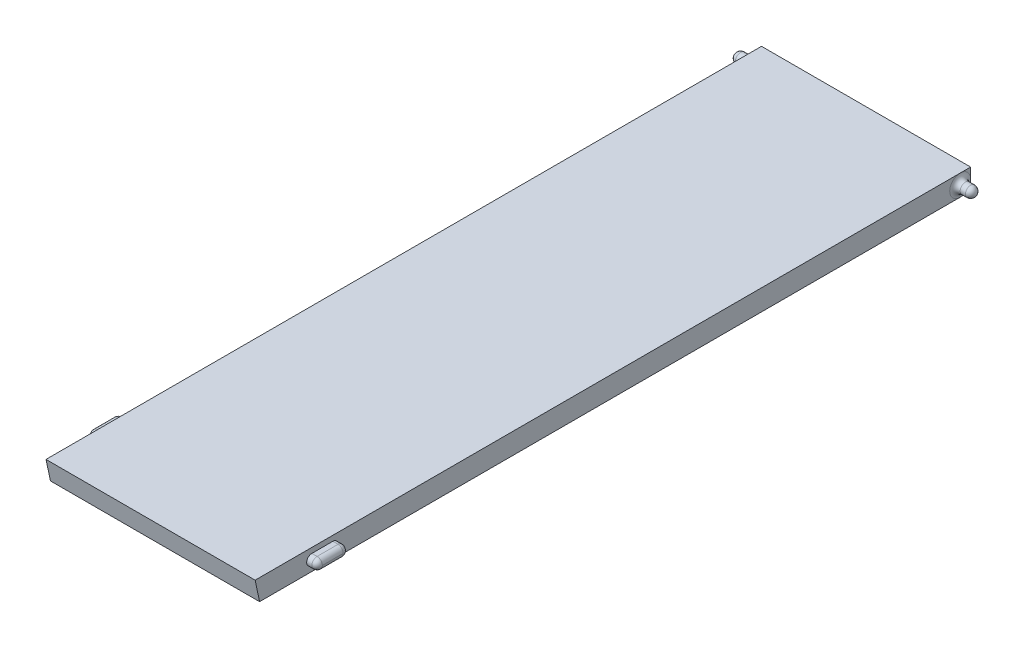
ISO-10303-21;
HEADER;
FILE_DESCRIPTION(('STEP AP214'),'2;1');
FILE_NAME('part.step','',(''),(''),'','','');
FILE_SCHEMA(('AUTOMOTIVE_DESIGN { 1 0 10303 214 1 1 1 1 }'));
ENDSEC;
DATA;
#1=APPLICATION_CONTEXT('core data for automotive mechanical design processes');
#2=APPLICATION_PROTOCOL_DEFINITION('international standard','automotive_design',2000,#1);
#3=PRODUCT_CONTEXT('',#1,'mechanical');
#4=PRODUCT('Part','Part','',(#3));
#5=PRODUCT_RELATED_PRODUCT_CATEGORY('part','',(#4));
#6=PRODUCT_DEFINITION_FORMATION('','',#4);
#7=PRODUCT_DEFINITION_CONTEXT('part definition',#1,'design');
#8=PRODUCT_DEFINITION('design','',#6,#7);
#9=PRODUCT_DEFINITION_SHAPE('','',#8);
#10=(LENGTH_UNIT() NAMED_UNIT(*) SI_UNIT(.MILLI.,.METRE.));
#11=(NAMED_UNIT(*) PLANE_ANGLE_UNIT() SI_UNIT($,.RADIAN.));
#12=(NAMED_UNIT(*) SI_UNIT($,.STERADIAN.) SOLID_ANGLE_UNIT());
#13=UNCERTAINTY_MEASURE_WITH_UNIT(LENGTH_MEASURE(1.E-05),#10,'distance_accuracy_value','');
#14=(GEOMETRIC_REPRESENTATION_CONTEXT(3) GLOBAL_UNCERTAINTY_ASSIGNED_CONTEXT((#13)) GLOBAL_UNIT_ASSIGNED_CONTEXT((#10,
#11,#12)) REPRESENTATION_CONTEXT('',''));
#15=CARTESIAN_POINT('',(0.,0.,0.));
#16=DIRECTION('',(0.,0.,1.));
#17=DIRECTION('',(1.,0.,0.));
#18=AXIS2_PLACEMENT_3D('',#15,#16,#17);
#19=CARTESIAN_POINT('',(-10.,2.,-34.));
#20=DIRECTION('',(1.,0.,0.));
#21=DIRECTION('',(0.,0.,-1.));
#22=AXIS2_PLACEMENT_3D('',#19,#20,#21);
#23=PLANE('',#22);
#24=DIRECTION('',(0.,-1.,0.));
#25=VECTOR('',#24,1.);
#26=CARTESIAN_POINT('',(-10.,2.,-34.));
#27=LINE('',#26,#25);
#28=CARTESIAN_POINT('',(-10.,2.,-34.));
#29=VERTEX_POINT('',#28);
#30=CARTESIAN_POINT('',(-10.,1.,-34.));
#31=VERTEX_POINT('',#30);
#32=EDGE_CURVE('E247',#29,#31,#27,.T.);
#33=ORIENTED_EDGE('',*,*,#32,.T.);
#34=CARTESIAN_POINT('',(-10.,1.,-33.));
#35=DIRECTION('',(-1.,0.,0.));
#36=DIRECTION('',(0.,0.,1.));
#37=AXIS2_PLACEMENT_3D('',#34,#35,#36);
#38=CIRCLE('',#37,0.999999999999999);
#39=CARTESIAN_POINT('',(-10.,2.,-33.));
#40=VERTEX_POINT('',#39);
#41=EDGE_CURVE('E226',#40,#31,#38,.T.);
#42=ORIENTED_EDGE('',*,*,#41,.F.);
#43=DIRECTION('',(0.,0.,1.));
#44=VECTOR('',#43,1.);
#45=CARTESIAN_POINT('',(-10.,2.,-34.));
#46=LINE('',#45,#44);
#47=EDGE_CURVE('E244',#29,#40,#46,.T.);
#48=ORIENTED_EDGE('',*,*,#47,.F.);
#49=EDGE_LOOP('',(#33,#42,#48));
#50=FACE_BOUND('',#49,.T.);
#51=ADVANCED_FACE('F37',(#50),#23,.F.);
#52=DIRECTION('',(0.,0.,1.));
#53=VECTOR('',#52,1.);
#54=CARTESIAN_POINT('',(-10.,1.50000000000001,-34.));
#55=LINE('',#54,#53);
#56=CARTESIAN_POINT('',(-10.,1.49999999999999,27.));
#57=VERTEX_POINT('',#56);
#58=CARTESIAN_POINT('',(-10.,1.49999999999999,29.));
#59=VERTEX_POINT('',#58);
#60=EDGE_CURVE('E179',#57,#59,#55,.T.);
#61=ORIENTED_EDGE('',*,*,#60,.T.);
#62=CARTESIAN_POINT('',(-10.,0.999999999999992,29.));
#63=DIRECTION('',(-1.,0.,0.));
#64=DIRECTION('',(0.,0.,1.));
#65=AXIS2_PLACEMENT_3D('',#62,#63,#64);
#66=CIRCLE('',#65,0.5);
#67=CARTESIAN_POINT('',(-10.,0.499999999999992,29.));
#68=VERTEX_POINT('',#67);
#69=EDGE_CURVE('E54',#68,#59,#66,.T.);
#70=ORIENTED_EDGE('',*,*,#69,.F.);
#71=DIRECTION('',(0.,0.,-1.));
#72=VECTOR('',#71,1.);
#73=CARTESIAN_POINT('',(-10.,0.500000000000013,-34.));
#74=LINE('',#73,#72);
#75=CARTESIAN_POINT('',(-10.,0.499999999999993,27.));
#76=VERTEX_POINT('',#75);
#77=EDGE_CURVE('E59',#68,#76,#74,.T.);
#78=ORIENTED_EDGE('',*,*,#77,.T.);
#79=CARTESIAN_POINT('',(-10.,0.999999999999993,27.));
#80=DIRECTION('',(-1.,0.,0.));
#81=DIRECTION('',(0.,0.,1.));
#82=AXIS2_PLACEMENT_3D('',#79,#80,#81);
#83=CIRCLE('',#82,0.5);
#84=EDGE_CURVE('E184',#57,#76,#83,.T.);
#85=ORIENTED_EDGE('',*,*,#84,.F.);
#86=EDGE_LOOP('',(#61,#70,#78,#85));
#87=FACE_BOUND('',#86,.T.);
#88=CARTESIAN_POINT('',(-10.,2.,34.4280326856988));
#89=VERTEX_POINT('',#88);
#90=EDGE_CURVE('E243',#40,#89,#46,.T.);
#91=ORIENTED_EDGE('',*,*,#90,.F.);
#92=CARTESIAN_POINT('',(-10.,0.,-33.));
#93=VERTEX_POINT('',#92);
#94=EDGE_CURVE('E225',#93,#40,#38,.T.);
#95=ORIENTED_EDGE('',*,*,#94,.F.);
#96=DIRECTION('',(0.,0.,1.));
#97=VECTOR('',#96,1.);
#98=CARTESIAN_POINT('',(-10.,0.,-34.));
#99=LINE('',#98,#97);
#100=CARTESIAN_POINT('',(-10.,0.,34.));
#101=VERTEX_POINT('',#100);
#102=EDGE_CURVE('E250',#93,#101,#99,.T.);
#103=ORIENTED_EDGE('',*,*,#102,.T.);
#104=DIRECTION('',(0.,0.97785634786908,0.20927723940301));
#105=VECTOR('',#104,1.);
#106=CARTESIAN_POINT('',(-10.,2.,34.4280326856988));
#107=LINE('',#106,#105);
#108=EDGE_CURVE('E211',#101,#89,#107,.T.);
#109=ORIENTED_EDGE('',*,*,#108,.T.);
#110=EDGE_LOOP('',(#91,#95,#103,#109));
#111=FACE_BOUND('',#110,.T.);
#112=ADVANCED_FACE('F337',(#87,#111),#23,.F.);
#113=CARTESIAN_POINT('',(10.,2.,-34.));
#114=DIRECTION('',(-1.,0.,0.));
#115=DIRECTION('',(0.,0.,1.));
#116=AXIS2_PLACEMENT_3D('',#113,#114,#115);
#117=PLANE('',#116);
#118=DIRECTION('',(0.,0.,-1.));
#119=VECTOR('',#118,1.);
#120=CARTESIAN_POINT('',(10.,2.,-34.));
#121=LINE('',#120,#119);
#122=CARTESIAN_POINT('',(10.,2.,-33.));
#123=VERTEX_POINT('',#122);
#124=CARTESIAN_POINT('',(10.,2.,-34.));
#125=VERTEX_POINT('',#124);
#126=EDGE_CURVE('E241',#123,#125,#121,.T.);
#127=ORIENTED_EDGE('',*,*,#126,.F.);
#128=CARTESIAN_POINT('',(10.,1.,-33.));
#129=DIRECTION('',(-1.,0.,0.));
#130=DIRECTION('',(0.,0.,1.));
#131=AXIS2_PLACEMENT_3D('',#128,#129,#130);
#132=CIRCLE('',#131,0.999999999999999);
#133=CARTESIAN_POINT('',(10.,1.,-34.));
#134=VERTEX_POINT('',#133);
#135=EDGE_CURVE('E269',#123,#134,#132,.T.);
#136=ORIENTED_EDGE('',*,*,#135,.T.);
#137=DIRECTION('',(0.,-1.,0.));
#138=VECTOR('',#137,1.);
#139=CARTESIAN_POINT('',(10.,2.,-34.));
#140=LINE('',#139,#138);
#141=EDGE_CURVE('E258',#125,#134,#140,.T.);
#142=ORIENTED_EDGE('',*,*,#141,.F.);
#143=EDGE_LOOP('',(#127,#136,#142));
#144=FACE_BOUND('',#143,.T.);
#145=ADVANCED_FACE('F343',(#144),#117,.F.);
#146=DIRECTION('',(0.,0.,-1.));
#147=VECTOR('',#146,1.);
#148=CARTESIAN_POINT('',(10.,0.500000000000013,-34.));
#149=LINE('',#148,#147);
#150=CARTESIAN_POINT('',(10.,0.499999999999992,29.));
#151=VERTEX_POINT('',#150);
#152=CARTESIAN_POINT('',(10.,0.499999999999993,27.));
#153=VERTEX_POINT('',#152);
#154=EDGE_CURVE('E205',#151,#153,#149,.T.);
#155=ORIENTED_EDGE('',*,*,#154,.F.);
#156=CARTESIAN_POINT('',(10.,0.999999999999992,29.));
#157=DIRECTION('',(-1.,0.,0.));
#158=DIRECTION('',(0.,0.,1.));
#159=AXIS2_PLACEMENT_3D('',#156,#157,#158);
#160=CIRCLE('',#159,0.5);
#161=CARTESIAN_POINT('',(10.,1.49999999999999,29.));
#162=VERTEX_POINT('',#161);
#163=EDGE_CURVE('E196',#151,#162,#160,.T.);
#164=ORIENTED_EDGE('',*,*,#163,.T.);
#165=DIRECTION('',(0.,0.,1.));
#166=VECTOR('',#165,1.);
#167=CARTESIAN_POINT('',(10.,1.50000000000001,-34.));
#168=LINE('',#167,#166);
#169=CARTESIAN_POINT('',(10.,1.49999999999999,27.));
#170=VERTEX_POINT('',#169);
#171=EDGE_CURVE('E199',#170,#162,#168,.T.);
#172=ORIENTED_EDGE('',*,*,#171,.F.);
#173=CARTESIAN_POINT('',(10.,0.999999999999993,27.));
#174=DIRECTION('',(-1.,0.,0.));
#175=DIRECTION('',(0.,0.,1.));
#176=AXIS2_PLACEMENT_3D('',#173,#174,#175);
#177=CIRCLE('',#176,0.5);
#178=EDGE_CURVE('E202',#170,#153,#177,.T.);
#179=ORIENTED_EDGE('',*,*,#178,.T.);
#180=EDGE_LOOP('',(#155,#164,#172,#179));
#181=FACE_BOUND('',#180,.T.);
#182=DIRECTION('',(0.,0.,-1.));
#183=VECTOR('',#182,1.);
#184=CARTESIAN_POINT('',(10.,0.,-34.));
#185=LINE('',#184,#183);
#186=CARTESIAN_POINT('',(10.,0.,34.));
#187=VERTEX_POINT('',#186);
#188=CARTESIAN_POINT('',(10.,0.,-33.));
#189=VERTEX_POINT('',#188);
#190=EDGE_CURVE('E236',#187,#189,#185,.T.);
#191=ORIENTED_EDGE('',*,*,#190,.T.);
#192=CARTESIAN_POINT('',(10.,1.,-33.));
#193=DIRECTION('',(-1.,0.,0.));
#194=DIRECTION('',(0.,0.,1.));
#195=AXIS2_PLACEMENT_3D('',#192,#193,#194);
#196=CIRCLE('',#195,0.999999999999999);
#197=EDGE_CURVE('E264',#189,#123,#196,.T.);
#198=ORIENTED_EDGE('',*,*,#197,.T.);
#199=CARTESIAN_POINT('',(10.,2.,34.4280326856988));
#200=VERTEX_POINT('',#199);
#201=EDGE_CURVE('E237',#200,#123,#121,.T.);
#202=ORIENTED_EDGE('',*,*,#201,.F.);
#203=DIRECTION('',(0.,0.97785634786908,0.20927723940301));
#204=VECTOR('',#203,1.);
#205=CARTESIAN_POINT('',(10.,2.,34.4280326856988));
#206=LINE('',#205,#204);
#207=EDGE_CURVE('E222',#187,#200,#206,.T.);
#208=ORIENTED_EDGE('',*,*,#207,.F.);
#209=EDGE_LOOP('',(#191,#198,#202,#208));
#210=FACE_BOUND('',#209,.T.);
#211=ADVANCED_FACE('F320',(#181,#210),#117,.F.);
#212=CARTESIAN_POINT('',(-10.,2.,-34.));
#213=DIRECTION('',(0.,0.,1.));
#214=DIRECTION('',(1.,0.,0.));
#215=AXIS2_PLACEMENT_3D('',#212,#213,#214);
#216=PLANE('',#215);
#217=ORIENTED_EDGE('',*,*,#141,.T.);
#218=DIRECTION('',(-1.,0.,0.));
#219=VECTOR('',#218,1.);
#220=CARTESIAN_POINT('',(-10.,1.,-34.));
#221=LINE('',#220,#219);
#222=EDGE_CURVE('E275',#134,#31,#221,.T.);
#223=ORIENTED_EDGE('',*,*,#222,.T.);
#224=ORIENTED_EDGE('',*,*,#32,.F.);
#225=DIRECTION('',(-1.,0.,0.));
#226=VECTOR('',#225,1.);
#227=CARTESIAN_POINT('',(-10.,2.,-34.));
#228=LINE('',#227,#226);
#229=EDGE_CURVE('E240',#125,#29,#228,.T.);
#230=ORIENTED_EDGE('',*,*,#229,.F.);
#231=EDGE_LOOP('',(#217,#223,#224,#230));
#232=FACE_BOUND('',#231,.T.);
#233=ADVANCED_FACE('F348',(#232),#216,.F.);
#234=CARTESIAN_POINT('',(0.,2.,0.));
#235=DIRECTION('',(0.,1.,0.));
#236=DIRECTION('',(0.,0.,1.));
#237=AXIS2_PLACEMENT_3D('',#234,#235,#236);
#238=PLANE('',#237);
#239=ORIENTED_EDGE('',*,*,#201,.T.);
#240=ORIENTED_EDGE('',*,*,#126,.T.);
#241=ORIENTED_EDGE('',*,*,#229,.T.);
#242=ORIENTED_EDGE('',*,*,#47,.T.);
#243=ORIENTED_EDGE('',*,*,#90,.T.);
#244=DIRECTION('',(-1.,0.,0.));
#245=VECTOR('',#244,1.);
#246=CARTESIAN_POINT('',(12.0452901945755,2.,34.4280326856988));
#247=LINE('',#246,#245);
#248=EDGE_CURVE('E219',#200,#89,#247,.T.);
#249=ORIENTED_EDGE('',*,*,#248,.F.);
#250=EDGE_LOOP('',(#239,#240,#241,#242,#243,#249));
#251=FACE_BOUND('',#250,.T.);
#252=ADVANCED_FACE('F351',(#251),#238,.T.);
#253=CARTESIAN_POINT('',(0.,0.,0.));
#254=DIRECTION('',(0.,1.,0.));
#255=DIRECTION('',(0.,0.,1.));
#256=AXIS2_PLACEMENT_3D('',#253,#254,#255);
#257=PLANE('',#256);
#258=ORIENTED_EDGE('',*,*,#102,.F.);
#259=DIRECTION('',(-1.,0.,0.));
#260=VECTOR('',#259,1.);
#261=CARTESIAN_POINT('',(0.,0.,-33.));
#262=LINE('',#261,#260);
#263=EDGE_CURVE('E278',#93,#189,#262,.F.);
#264=ORIENTED_EDGE('',*,*,#263,.T.);
#265=ORIENTED_EDGE('',*,*,#190,.F.);
#266=DIRECTION('',(1.,0.,0.));
#267=VECTOR('',#266,1.);
#268=CARTESIAN_POINT('',(-10.,0.,34.));
#269=LINE('',#268,#267);
#270=EDGE_CURVE('E253',#101,#187,#269,.T.);
#271=ORIENTED_EDGE('',*,*,#270,.F.);
#272=EDGE_LOOP('',(#258,#264,#265,#271));
#273=FACE_BOUND('',#272,.T.);
#274=ADVANCED_FACE('F346',(#273),#257,.F.);
#275=CARTESIAN_POINT('',(11.5,1.,-33.));
#276=DIRECTION('',(-1.,0.,0.));
#277=DIRECTION('',(0.,0.,1.));
#278=AXIS2_PLACEMENT_3D('',#275,#276,#277);
#279=CYLINDRICAL_SURFACE('',#278,0.499999999999999);
#280=CARTESIAN_POINT('',(10.5,1.,-33.));
#281=DIRECTION('',(-1.,0.,0.));
#282=DIRECTION('',(0.,0.,1.));
#283=AXIS2_PLACEMENT_3D('',#280,#281,#282);
#284=CIRCLE('',#283,0.499999999999999);
#285=CARTESIAN_POINT('',(10.5,1.,-32.5));
#286=VERTEX_POINT('',#285);
#287=EDGE_CURVE('E272',#286,#286,#284,.F.);
#288=ORIENTED_EDGE('',*,*,#287,.T.);
#289=EDGE_LOOP('',(#288));
#290=FACE_BOUND('',#289,.T.);
#291=CARTESIAN_POINT('',(11.,1.,-33.));
#292=DIRECTION('',(-1.,0.,0.));
#293=DIRECTION('',(0.,0.,1.));
#294=AXIS2_PLACEMENT_3D('',#291,#292,#293);
#295=CIRCLE('',#294,0.499999999999999);
#296=CARTESIAN_POINT('',(11.,1.,-32.5));
#297=VERTEX_POINT('',#296);
#298=EDGE_CURVE('E261',#297,#297,#295,.T.);
#299=ORIENTED_EDGE('',*,*,#298,.T.);
#300=EDGE_LOOP('',(#299));
#301=FACE_BOUND('',#300,.T.);
#302=ADVANCED_FACE('F359',(#290,#301),#279,.T.);
#303=CARTESIAN_POINT('',(11.,1.,-33.));
#304=DIRECTION('',(-1.,0.,0.));
#305=DIRECTION('',(0.,0.,1.));
#306=AXIS2_PLACEMENT_3D('',#303,#304,#305);
#307=SPHERICAL_SURFACE('',#306,0.5);
#308=ORIENTED_EDGE('',*,*,#298,.F.);
#309=EDGE_LOOP('',(#308));
#310=FACE_BOUND('',#309,.T.);
#311=ADVANCED_FACE('F355',(#310),#307,.T.);
#312=CARTESIAN_POINT('',(10.5,1.,-33.));
#313=DIRECTION('',(-1.,0.,0.));
#314=DIRECTION('',(0.,0.,1.));
#315=AXIS2_PLACEMENT_3D('',#312,#313,#314);
#316=TOROIDAL_SURFACE('',#315,0.999999999999999,0.5);
#317=ORIENTED_EDGE('',*,*,#287,.F.);
#318=EDGE_LOOP('',(#317));
#319=FACE_BOUND('',#318,.T.);
#320=CARTESIAN_POINT('',(10.,1.,-33.));
#321=DIRECTION('',(-1.,0.,0.));
#322=DIRECTION('',(0.,0.,1.));
#323=AXIS2_PLACEMENT_3D('',#320,#321,#322);
#324=CIRCLE('',#323,0.999999999999999);
#325=EDGE_CURVE('E266',#134,#189,#324,.T.);
#326=ORIENTED_EDGE('',*,*,#325,.F.);
#327=ORIENTED_EDGE('',*,*,#135,.F.);
#328=ORIENTED_EDGE('',*,*,#197,.F.);
#329=EDGE_LOOP('',(#326,#327,#328));
#330=FACE_BOUND('',#329,.T.);
#331=ADVANCED_FACE('F358',(#319,#330),#316,.F.);
#332=CARTESIAN_POINT('',(-10.5,1.,-33.));
#333=DIRECTION('',(1.,0.,0.));
#334=DIRECTION('',(0.,0.,1.));
#335=AXIS2_PLACEMENT_3D('',#332,#333,#334);
#336=TOROIDAL_SURFACE('',#335,0.999999999999999,0.5);
#337=CARTESIAN_POINT('',(-10.5,1.,-33.));
#338=DIRECTION('',(-1.,0.,0.));
#339=DIRECTION('',(0.,0.,1.));
#340=AXIS2_PLACEMENT_3D('',#337,#338,#339);
#341=CIRCLE('',#340,0.499999999999999);
#342=CARTESIAN_POINT('',(-10.5,1.,-32.5));
#343=VERTEX_POINT('',#342);
#344=EDGE_CURVE('E233',#343,#343,#341,.F.);
#345=ORIENTED_EDGE('',*,*,#344,.T.);
#346=EDGE_LOOP('',(#345));
#347=FACE_BOUND('',#346,.T.);
#348=ORIENTED_EDGE('',*,*,#41,.T.);
#349=EDGE_CURVE('E230',#31,#93,#38,.T.);
#350=ORIENTED_EDGE('',*,*,#349,.T.);
#351=ORIENTED_EDGE('',*,*,#94,.T.);
#352=EDGE_LOOP('',(#348,#350,#351));
#353=FACE_BOUND('',#352,.T.);
#354=ADVANCED_FACE('F363',(#347,#353),#336,.F.);
#355=CARTESIAN_POINT('',(-11.5,1.,-33.));
#356=DIRECTION('',(1.,0.,0.));
#357=DIRECTION('',(0.,0.,1.));
#358=AXIS2_PLACEMENT_3D('',#355,#356,#357);
#359=CYLINDRICAL_SURFACE('',#358,0.499999999999999);
#360=ORIENTED_EDGE('',*,*,#344,.F.);
#361=EDGE_LOOP('',(#360));
#362=FACE_BOUND('',#361,.T.);
#363=CARTESIAN_POINT('',(-11.,1.,-33.));
#364=DIRECTION('',(-1.,0.,0.));
#365=DIRECTION('',(0.,0.,1.));
#366=AXIS2_PLACEMENT_3D('',#363,#364,#365);
#367=CIRCLE('',#366,0.499999999999999);
#368=CARTESIAN_POINT('',(-11.,1.,-32.5));
#369=VERTEX_POINT('',#368);
#370=EDGE_CURVE('E229',#369,#369,#367,.T.);
#371=ORIENTED_EDGE('',*,*,#370,.F.);
#372=EDGE_LOOP('',(#371));
#373=FACE_BOUND('',#372,.T.);
#374=ADVANCED_FACE('F583',(#362,#373),#359,.T.);
#375=CARTESIAN_POINT('',(-11.,1.,-33.));
#376=DIRECTION('',(1.,0.,0.));
#377=DIRECTION('',(0.,0.,1.));
#378=AXIS2_PLACEMENT_3D('',#375,#376,#377);
#379=SPHERICAL_SURFACE('',#378,0.5);
#380=ORIENTED_EDGE('',*,*,#370,.T.);
#381=EDGE_LOOP('',(#380));
#382=FACE_BOUND('',#381,.T.);
#383=ADVANCED_FACE('F369',(#382),#379,.T.);
#384=CARTESIAN_POINT('',(-10.,1.,-33.));
#385=DIRECTION('',(-1.,0.,0.));
#386=DIRECTION('',(0.,0.,1.));
#387=AXIS2_PLACEMENT_3D('',#384,#385,#386);
#388=CYLINDRICAL_SURFACE('',#387,1.);
#389=ORIENTED_EDGE('',*,*,#325,.T.);
#390=ORIENTED_EDGE('',*,*,#263,.F.);
#391=ORIENTED_EDGE('',*,*,#349,.F.);
#392=ORIENTED_EDGE('',*,*,#222,.F.);
#393=EDGE_LOOP('',(#389,#390,#391,#392));
#394=FACE_BOUND('',#393,.T.);
#395=ADVANCED_FACE('F365',(#394),#388,.T.);
#396=CARTESIAN_POINT('',(12.0452901945755,2.,34.4280326856988));
#397=DIRECTION('',(0.,0.20927723940301,-0.97785634786908));
#398=DIRECTION('',(0.,0.97785634786908,0.20927723940301));
#399=AXIS2_PLACEMENT_3D('',#396,#397,#398);
#400=PLANE('',#399);
#401=ORIENTED_EDGE('',*,*,#270,.T.);
#402=ORIENTED_EDGE('',*,*,#207,.T.);
#403=ORIENTED_EDGE('',*,*,#248,.T.);
#404=ORIENTED_EDGE('',*,*,#108,.F.);
#405=EDGE_LOOP('',(#401,#402,#403,#404));
#406=FACE_BOUND('',#405,.T.);
#407=ADVANCED_FACE('F368',(#406),#400,.F.);
#408=CARTESIAN_POINT('',(11.,0.999999999999992,29.));
#409=DIRECTION('',(-1.,0.,0.));
#410=DIRECTION('',(0.,0.,1.));
#411=AXIS2_PLACEMENT_3D('',#408,#409,#410);
#412=CYLINDRICAL_SURFACE('',#411,0.5);
#413=DIRECTION('',(-1.,0.,0.));
#414=VECTOR('',#413,1.);
#415=CARTESIAN_POINT('',(11.,0.499999999999992,29.));
#416=LINE('',#415,#414);
#417=CARTESIAN_POINT('',(10.5,0.499999999999992,29.));
#418=VERTEX_POINT('',#417);
#419=EDGE_CURVE('E209',#418,#151,#416,.T.);
#420=ORIENTED_EDGE('',*,*,#419,.F.);
#421=CARTESIAN_POINT('',(10.5,0.999999999999992,29.));
#422=DIRECTION('',(-1.,0.,0.));
#423=DIRECTION('',(0.,0.,1.));
#424=AXIS2_PLACEMENT_3D('',#421,#422,#423);
#425=CIRCLE('',#424,0.5);
#426=CARTESIAN_POINT('',(10.5,1.49999999999999,29.));
#427=VERTEX_POINT('',#426);
#428=EDGE_CURVE('E46',#418,#427,#425,.T.);
#429=ORIENTED_EDGE('',*,*,#428,.T.);
#430=DIRECTION('',(-1.,0.,0.));
#431=VECTOR('',#430,1.);
#432=CARTESIAN_POINT('',(11.,1.49999999999999,29.));
#433=LINE('',#432,#431);
#434=EDGE_CURVE('E208',#427,#162,#433,.T.);
#435=ORIENTED_EDGE('',*,*,#434,.T.);
#436=ORIENTED_EDGE('',*,*,#163,.F.);
#437=EDGE_LOOP('',(#420,#429,#435,#436));
#438=FACE_BOUND('',#437,.T.);
#439=ADVANCED_FACE('F324',(#438),#412,.T.);
#440=CARTESIAN_POINT('',(11.,0.500000000000013,-34.));
#441=DIRECTION('',(0.,1.,0.));
#442=DIRECTION('',(0.,0.,1.));
#443=AXIS2_PLACEMENT_3D('',#440,#441,#442);
#444=PLANE('',#443);
#445=DIRECTION('',(-1.,0.,0.));
#446=VECTOR('',#445,1.);
#447=CARTESIAN_POINT('',(11.,0.499999999999993,27.));
#448=LINE('',#447,#446);
#449=CARTESIAN_POINT('',(10.5,0.499999999999993,27.));
#450=VERTEX_POINT('',#449);
#451=EDGE_CURVE('E212',#450,#153,#448,.T.);
#452=ORIENTED_EDGE('',*,*,#451,.F.);
#453=DIRECTION('',(0.,0.,-1.));
#454=VECTOR('',#453,1.);
#455=CARTESIAN_POINT('',(10.5,0.500000000000013,-34.));
#456=LINE('',#455,#454);
#457=EDGE_CURVE('E283',#450,#418,#456,.F.);
#458=ORIENTED_EDGE('',*,*,#457,.T.);
#459=ORIENTED_EDGE('',*,*,#419,.T.);
#460=ORIENTED_EDGE('',*,*,#154,.T.);
#461=EDGE_LOOP('',(#452,#458,#459,#460));
#462=FACE_BOUND('',#461,.T.);
#463=ADVANCED_FACE('F315',(#462),#444,.F.);
#464=CARTESIAN_POINT('',(11.,0.999999999999993,27.));
#465=DIRECTION('',(-1.,0.,0.));
#466=DIRECTION('',(0.,0.,1.));
#467=AXIS2_PLACEMENT_3D('',#464,#465,#466);
#468=CYLINDRICAL_SURFACE('',#467,0.5);
#469=DIRECTION('',(-1.,0.,0.));
#470=VECTOR('',#469,1.);
#471=CARTESIAN_POINT('',(11.,1.49999999999999,27.));
#472=LINE('',#471,#470);
#473=CARTESIAN_POINT('',(10.5,1.49999999999999,27.));
#474=VERTEX_POINT('',#473);
#475=EDGE_CURVE('E214',#474,#170,#472,.T.);
#476=ORIENTED_EDGE('',*,*,#475,.F.);
#477=CARTESIAN_POINT('',(10.5,0.999999999999993,27.));
#478=DIRECTION('',(-1.,0.,0.));
#479=DIRECTION('',(0.,0.,1.));
#480=AXIS2_PLACEMENT_3D('',#477,#478,#479);
#481=CIRCLE('',#480,0.5);
#482=EDGE_CURVE('E280',#474,#450,#481,.T.);
#483=ORIENTED_EDGE('',*,*,#482,.T.);
#484=ORIENTED_EDGE('',*,*,#451,.T.);
#485=ORIENTED_EDGE('',*,*,#178,.F.);
#486=EDGE_LOOP('',(#476,#483,#484,#485));
#487=FACE_BOUND('',#486,.T.);
#488=ADVANCED_FACE('F312',(#487),#468,.T.);
#489=CARTESIAN_POINT('',(11.,1.50000000000001,-34.));
#490=DIRECTION('',(0.,-1.,0.));
#491=DIRECTION('',(0.,0.,-1.));
#492=AXIS2_PLACEMENT_3D('',#489,#490,#491);
#493=PLANE('',#492);
#494=ORIENTED_EDGE('',*,*,#434,.F.);
#495=DIRECTION('',(0.,0.,1.));
#496=VECTOR('',#495,1.);
#497=CARTESIAN_POINT('',(10.5,1.50000000000001,-34.));
#498=LINE('',#497,#496);
#499=EDGE_CURVE('E11',#427,#474,#498,.F.);
#500=ORIENTED_EDGE('',*,*,#499,.T.);
#501=ORIENTED_EDGE('',*,*,#475,.T.);
#502=ORIENTED_EDGE('',*,*,#171,.T.);
#503=EDGE_LOOP('',(#494,#500,#501,#502));
#504=FACE_BOUND('',#503,.T.);
#505=ADVANCED_FACE('F327',(#504),#493,.F.);
#506=CARTESIAN_POINT('',(10.5,0.999999999999992,29.));
#507=DIRECTION('',(-1.,0.,0.));
#508=DIRECTION('',(0.,0.,1.));
#509=AXIS2_PLACEMENT_3D('',#506,#507,#508);
#510=SPHERICAL_SURFACE('',#509,0.5);
#511=CARTESIAN_POINT('',(10.5,0.999999999999992,29.));
#512=DIRECTION('',(0.,0.,-1.));
#513=DIRECTION('',(-1.,0.,0.));
#514=AXIS2_PLACEMENT_3D('',#511,#512,#513);
#515=CIRCLE('',#514,0.5);
#516=CARTESIAN_POINT('',(11.,0.999999999999992,29.));
#517=VERTEX_POINT('',#516);
#518=EDGE_CURVE('E41',#427,#517,#515,.T.);
#519=ORIENTED_EDGE('',*,*,#518,.F.);
#520=ORIENTED_EDGE('',*,*,#428,.F.);
#521=CARTESIAN_POINT('',(10.5,0.999999999999992,29.));
#522=DIRECTION('',(0.,0.,-1.));
#523=DIRECTION('',(-1.,0.,0.));
#524=AXIS2_PLACEMENT_3D('',#521,#522,#523);
#525=CIRCLE('',#524,0.5);
#526=EDGE_CURVE('E292',#517,#418,#525,.T.);
#527=ORIENTED_EDGE('',*,*,#526,.F.);
#528=EDGE_LOOP('',(#519,#520,#527));
#529=FACE_BOUND('',#528,.T.);
#530=ADVANCED_FACE('F39',(#529),#510,.T.);
#531=CARTESIAN_POINT('',(10.5,0.999999999999992,29.));
#532=DIRECTION('',(0.,0.,1.));
#533=DIRECTION('',(0.,-1.,0.));
#534=AXIS2_PLACEMENT_3D('',#531,#532,#533);
#535=CYLINDRICAL_SURFACE('',#534,0.5);
#536=ORIENTED_EDGE('',*,*,#499,.F.);
#537=ORIENTED_EDGE('',*,*,#518,.T.);
#538=DIRECTION('',(0.,0.,1.));
#539=VECTOR('',#538,1.);
#540=CARTESIAN_POINT('',(11.,0.999999999999992,29.));
#541=LINE('',#540,#539);
#542=CARTESIAN_POINT('',(11.,0.999999999999993,27.));
#543=VERTEX_POINT('',#542);
#544=EDGE_CURVE('E290',#543,#517,#541,.T.);
#545=ORIENTED_EDGE('',*,*,#544,.F.);
#546=CARTESIAN_POINT('',(10.5,0.999999999999993,27.));
#547=DIRECTION('',(0.,0.,-1.));
#548=DIRECTION('',(-1.,0.,0.));
#549=AXIS2_PLACEMENT_3D('',#546,#547,#548);
#550=CIRCLE('',#549,0.5);
#551=EDGE_CURVE('E287',#474,#543,#550,.T.);
#552=ORIENTED_EDGE('',*,*,#551,.F.);
#553=EDGE_LOOP('',(#536,#537,#545,#552));
#554=FACE_BOUND('',#553,.T.);
#555=ADVANCED_FACE('F300',(#554),#535,.T.);
#556=CARTESIAN_POINT('',(10.5,0.999999999999992,29.));
#557=DIRECTION('',(0.,0.,-1.));
#558=DIRECTION('',(0.,1.,0.));
#559=AXIS2_PLACEMENT_3D('',#556,#557,#558);
#560=CYLINDRICAL_SURFACE('',#559,0.5);
#561=ORIENTED_EDGE('',*,*,#526,.T.);
#562=ORIENTED_EDGE('',*,*,#457,.F.);
#563=CARTESIAN_POINT('',(10.5,0.999999999999993,27.));
#564=DIRECTION('',(0.,0.,-1.));
#565=DIRECTION('',(-1.,0.,0.));
#566=AXIS2_PLACEMENT_3D('',#563,#564,#565);
#567=CIRCLE('',#566,0.5);
#568=EDGE_CURVE('E195',#543,#450,#567,.T.);
#569=ORIENTED_EDGE('',*,*,#568,.F.);
#570=ORIENTED_EDGE('',*,*,#544,.T.);
#571=EDGE_LOOP('',(#561,#562,#569,#570));
#572=FACE_BOUND('',#571,.T.);
#573=ADVANCED_FACE('F305',(#572),#560,.T.);
#574=CARTESIAN_POINT('',(10.5,0.999999999999993,27.));
#575=DIRECTION('',(-1.,0.,0.));
#576=DIRECTION('',(0.,0.,1.));
#577=AXIS2_PLACEMENT_3D('',#574,#575,#576);
#578=SPHERICAL_SURFACE('',#577,0.5);
#579=ORIENTED_EDGE('',*,*,#482,.F.);
#580=ORIENTED_EDGE('',*,*,#551,.T.);
#581=ORIENTED_EDGE('',*,*,#568,.T.);
#582=EDGE_LOOP('',(#579,#580,#581));
#583=FACE_BOUND('',#582,.T.);
#584=ADVANCED_FACE('F308',(#583),#578,.T.);
#585=CARTESIAN_POINT('',(-11.,0.999999999999992,29.));
#586=DIRECTION('',(1.,0.,0.));
#587=DIRECTION('',(0.,0.,1.));
#588=AXIS2_PLACEMENT_3D('',#585,#586,#587);
#589=CYLINDRICAL_SURFACE('',#588,0.5);
#590=DIRECTION('',(1.,0.,0.));
#591=VECTOR('',#590,1.);
#592=CARTESIAN_POINT('',(-11.,0.499999999999992,29.));
#593=LINE('',#592,#591);
#594=CARTESIAN_POINT('',(-10.5,0.499999999999992,29.));
#595=VERTEX_POINT('',#594);
#596=EDGE_CURVE('E191',#595,#68,#593,.T.);
#597=ORIENTED_EDGE('',*,*,#596,.T.);
#598=ORIENTED_EDGE('',*,*,#69,.T.);
#599=DIRECTION('',(1.,0.,0.));
#600=VECTOR('',#599,1.);
#601=CARTESIAN_POINT('',(-11.,1.49999999999999,29.));
#602=LINE('',#601,#600);
#603=CARTESIAN_POINT('',(-10.5,1.49999999999999,29.));
#604=VERTEX_POINT('',#603);
#605=EDGE_CURVE('E182',#604,#59,#602,.T.);
#606=ORIENTED_EDGE('',*,*,#605,.F.);
#607=CARTESIAN_POINT('',(-10.5,0.999999999999992,29.));
#608=DIRECTION('',(-1.,0.,0.));
#609=DIRECTION('',(0.,0.,1.));
#610=AXIS2_PLACEMENT_3D('',#607,#608,#609);
#611=CIRCLE('',#610,0.5);
#612=EDGE_CURVE('E186',#595,#604,#611,.T.);
#613=ORIENTED_EDGE('',*,*,#612,.F.);
#614=EDGE_LOOP('',(#597,#598,#606,#613));
#615=FACE_BOUND('',#614,.T.);
#616=ADVANCED_FACE('F373',(#615),#589,.T.);
#617=CARTESIAN_POINT('',(-11.,0.500000000000013,-34.));
#618=DIRECTION('',(0.,1.,0.));
#619=DIRECTION('',(0.,0.,1.));
#620=AXIS2_PLACEMENT_3D('',#617,#618,#619);
#621=PLANE('',#620);
#622=DIRECTION('',(1.,0.,0.));
#623=VECTOR('',#622,1.);
#624=CARTESIAN_POINT('',(-11.,0.499999999999993,27.));
#625=LINE('',#624,#623);
#626=CARTESIAN_POINT('',(-10.5,0.499999999999993,27.));
#627=VERTEX_POINT('',#626);
#628=EDGE_CURVE('E178',#627,#76,#625,.T.);
#629=ORIENTED_EDGE('',*,*,#628,.T.);
#630=ORIENTED_EDGE('',*,*,#77,.F.);
#631=ORIENTED_EDGE('',*,*,#596,.F.);
#632=DIRECTION('',(0.,0.,-1.));
#633=VECTOR('',#632,1.);
#634=CARTESIAN_POINT('',(-10.5,0.500000000000013,-34.));
#635=LINE('',#634,#633);
#636=EDGE_CURVE('E705',#627,#595,#635,.F.);
#637=ORIENTED_EDGE('',*,*,#636,.F.);
#638=EDGE_LOOP('',(#629,#630,#631,#637));
#639=FACE_BOUND('',#638,.T.);
#640=ADVANCED_FACE('F395',(#639),#621,.F.);
#641=CARTESIAN_POINT('',(-11.,0.999999999999993,27.));
#642=DIRECTION('',(1.,0.,0.));
#643=DIRECTION('',(0.,0.,1.));
#644=AXIS2_PLACEMENT_3D('',#641,#642,#643);
#645=CYLINDRICAL_SURFACE('',#644,0.5);
#646=DIRECTION('',(1.,0.,0.));
#647=VECTOR('',#646,1.);
#648=CARTESIAN_POINT('',(-11.,1.49999999999999,27.));
#649=LINE('',#648,#647);
#650=CARTESIAN_POINT('',(-10.5,1.49999999999999,27.));
#651=VERTEX_POINT('',#650);
#652=EDGE_CURVE('E176',#651,#57,#649,.T.);
#653=ORIENTED_EDGE('',*,*,#652,.T.);
#654=ORIENTED_EDGE('',*,*,#84,.T.);
#655=ORIENTED_EDGE('',*,*,#628,.F.);
#656=CARTESIAN_POINT('',(-10.5,0.999999999999993,27.));
#657=DIRECTION('',(-1.,0.,0.));
#658=DIRECTION('',(0.,0.,1.));
#659=AXIS2_PLACEMENT_3D('',#656,#657,#658);
#660=CIRCLE('',#659,0.5);
#661=EDGE_CURVE('E154',#651,#627,#660,.T.);
#662=ORIENTED_EDGE('',*,*,#661,.F.);
#663=EDGE_LOOP('',(#653,#654,#655,#662));
#664=FACE_BOUND('',#663,.T.);
#665=ADVANCED_FACE('F174',(#664),#645,.T.);
#666=CARTESIAN_POINT('',(-11.,1.50000000000001,-34.));
#667=DIRECTION('',(0.,-1.,0.));
#668=DIRECTION('',(0.,0.,-1.));
#669=AXIS2_PLACEMENT_3D('',#666,#667,#668);
#670=PLANE('',#669);
#671=ORIENTED_EDGE('',*,*,#605,.T.);
#672=ORIENTED_EDGE('',*,*,#60,.F.);
#673=ORIENTED_EDGE('',*,*,#652,.F.);
#674=DIRECTION('',(0.,0.,1.));
#675=VECTOR('',#674,1.);
#676=CARTESIAN_POINT('',(-10.5,1.50000000000001,-34.));
#677=LINE('',#676,#675);
#678=EDGE_CURVE('E161',#604,#651,#677,.F.);
#679=ORIENTED_EDGE('',*,*,#678,.F.);
#680=EDGE_LOOP('',(#671,#672,#673,#679));
#681=FACE_BOUND('',#680,.T.);
#682=ADVANCED_FACE('F181',(#681),#670,.F.);
#683=CARTESIAN_POINT('',(-10.5,0.999999999999992,29.));
#684=DIRECTION('',(1.,0.,0.));
#685=DIRECTION('',(0.,0.,1.));
#686=AXIS2_PLACEMENT_3D('',#683,#684,#685);
#687=SPHERICAL_SURFACE('',#686,0.5);
#688=CARTESIAN_POINT('',(-10.5,0.999999999999992,29.));
#689=DIRECTION('',(0.,0.,1.));
#690=DIRECTION('',(1.,0.,0.));
#691=AXIS2_PLACEMENT_3D('',#688,#689,#690);
#692=CIRCLE('',#691,0.5);
#693=CARTESIAN_POINT('',(-11.,0.999999999999992,29.));
#694=VERTEX_POINT('',#693);
#695=EDGE_CURVE('E164',#604,#694,#692,.T.);
#696=ORIENTED_EDGE('',*,*,#695,.T.);
#697=CARTESIAN_POINT('',(-10.5,0.999999999999992,29.));
#698=DIRECTION('',(0.,0.,1.));
#699=DIRECTION('',(1.,0.,0.));
#700=AXIS2_PLACEMENT_3D('',#697,#698,#699);
#701=CIRCLE('',#700,0.5);
#702=EDGE_CURVE('E704',#694,#595,#701,.T.);
#703=ORIENTED_EDGE('',*,*,#702,.T.);
#704=ORIENTED_EDGE('',*,*,#612,.T.);
#705=EDGE_LOOP('',(#696,#703,#704));
#706=FACE_BOUND('',#705,.T.);
#707=ADVANCED_FACE('F416',(#706),#687,.T.);
#708=CARTESIAN_POINT('',(-10.5,0.999999999999992,29.));
#709=DIRECTION('',(0.,0.,1.));
#710=DIRECTION('',(0.,-1.,0.));
#711=AXIS2_PLACEMENT_3D('',#708,#709,#710);
#712=CYLINDRICAL_SURFACE('',#711,0.5);
#713=ORIENTED_EDGE('',*,*,#678,.T.);
#714=CARTESIAN_POINT('',(-10.5,0.999999999999993,27.));
#715=DIRECTION('',(0.,0.,1.));
#716=DIRECTION('',(1.,0.,0.));
#717=AXIS2_PLACEMENT_3D('',#714,#715,#716);
#718=CIRCLE('',#717,0.5);
#719=CARTESIAN_POINT('',(-11.,0.999999999999993,27.));
#720=VERTEX_POINT('',#719);
#721=EDGE_CURVE('E150',#651,#720,#718,.T.);
#722=ORIENTED_EDGE('',*,*,#721,.T.);
#723=DIRECTION('',(0.,0.,1.));
#724=VECTOR('',#723,1.);
#725=CARTESIAN_POINT('',(-11.,0.999999999999992,29.));
#726=LINE('',#725,#724);
#727=EDGE_CURVE('E169',#720,#694,#726,.T.);
#728=ORIENTED_EDGE('',*,*,#727,.T.);
#729=ORIENTED_EDGE('',*,*,#695,.F.);
#730=EDGE_LOOP('',(#713,#722,#728,#729));
#731=FACE_BOUND('',#730,.T.);
#732=ADVANCED_FACE('F162',(#731),#712,.T.);
#733=CARTESIAN_POINT('',(-10.5,0.999999999999992,29.));
#734=DIRECTION('',(0.,0.,-1.));
#735=DIRECTION('',(0.,1.,0.));
#736=AXIS2_PLACEMENT_3D('',#733,#734,#735);
#737=CYLINDRICAL_SURFACE('',#736,0.5);
#738=ORIENTED_EDGE('',*,*,#702,.F.);
#739=ORIENTED_EDGE('',*,*,#727,.F.);
#740=CARTESIAN_POINT('',(-10.5,0.999999999999993,27.));
#741=DIRECTION('',(0.,0.,1.));
#742=DIRECTION('',(1.,0.,0.));
#743=AXIS2_PLACEMENT_3D('',#740,#741,#742);
#744=CIRCLE('',#743,0.5);
#745=EDGE_CURVE('E156',#720,#627,#744,.T.);
#746=ORIENTED_EDGE('',*,*,#745,.T.);
#747=ORIENTED_EDGE('',*,*,#636,.T.);
#748=EDGE_LOOP('',(#738,#739,#746,#747));
#749=FACE_BOUND('',#748,.T.);
#750=ADVANCED_FACE('F430',(#749),#737,.T.);
#751=CARTESIAN_POINT('',(-10.5,0.999999999999993,27.));
#752=DIRECTION('',(1.,0.,0.));
#753=DIRECTION('',(0.,0.,1.));
#754=AXIS2_PLACEMENT_3D('',#751,#752,#753);
#755=SPHERICAL_SURFACE('',#754,0.5);
#756=ORIENTED_EDGE('',*,*,#661,.T.);
#757=ORIENTED_EDGE('',*,*,#745,.F.);
#758=ORIENTED_EDGE('',*,*,#721,.F.);
#759=EDGE_LOOP('',(#756,#757,#758));
#760=FACE_BOUND('',#759,.T.);
#761=ADVANCED_FACE('F152',(#760),#755,.T.);
#762=CLOSED_SHELL('',(#51,#112,#145,#211,#233,#252,#274,#302,#311,#331,#354,#374,#383,#395,#407,
#439,#463,#488,#505,#530,#555,#573,#584,#616,#640,#665,#682,#707,#732,#750,#761));
#763=MANIFOLD_SOLID_BREP('B2',#762);
#764=ADVANCED_BREP_SHAPE_REPRESENTATION('',(#18,#763),#14);
#765=SHAPE_DEFINITION_REPRESENTATION(#9,#764);
ENDSEC;
END-ISO-10303-21;
